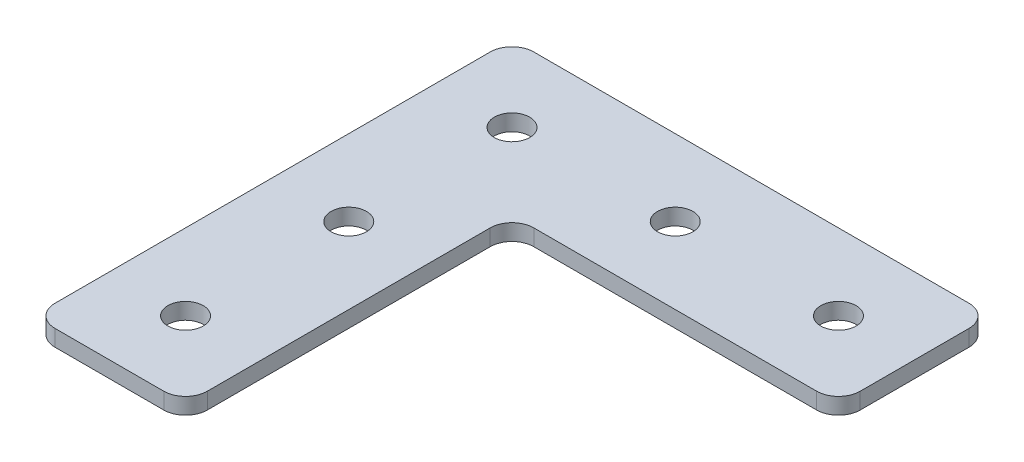
ISO-10303-21;
HEADER;
FILE_DESCRIPTION(('STEP AP214'),'2;1');
FILE_NAME('part.step','',(''),(''),'','','');
FILE_SCHEMA(('AUTOMOTIVE_DESIGN { 1 0 10303 214 1 1 1 1 }'));
ENDSEC;
DATA;
#1=APPLICATION_CONTEXT('core data for automotive mechanical design processes');
#2=APPLICATION_PROTOCOL_DEFINITION('international standard','automotive_design',2000,#1);
#3=PRODUCT_CONTEXT('',#1,'mechanical');
#4=PRODUCT('Part','Part','',(#3));
#5=PRODUCT_RELATED_PRODUCT_CATEGORY('part','',(#4));
#6=PRODUCT_DEFINITION_FORMATION('','',#4);
#7=PRODUCT_DEFINITION_CONTEXT('part definition',#1,'design');
#8=PRODUCT_DEFINITION('design','',#6,#7);
#9=PRODUCT_DEFINITION_SHAPE('','',#8);
#10=(LENGTH_UNIT() NAMED_UNIT(*) SI_UNIT(.MILLI.,.METRE.));
#11=(NAMED_UNIT(*) PLANE_ANGLE_UNIT() SI_UNIT($,.RADIAN.));
#12=(NAMED_UNIT(*) SI_UNIT($,.STERADIAN.) SOLID_ANGLE_UNIT());
#13=UNCERTAINTY_MEASURE_WITH_UNIT(LENGTH_MEASURE(1.E-05),#10,'distance_accuracy_value','');
#14=(GEOMETRIC_REPRESENTATION_CONTEXT(3) GLOBAL_UNCERTAINTY_ASSIGNED_CONTEXT((#13)) GLOBAL_UNIT_ASSIGNED_CONTEXT((#10,
#11,#12)) REPRESENTATION_CONTEXT('',''));
#15=CARTESIAN_POINT('',(0.,0.,0.));
#16=DIRECTION('',(0.,0.,1.));
#17=DIRECTION('',(1.,0.,0.));
#18=AXIS2_PLACEMENT_3D('',#15,#16,#17);
#19=CARTESIAN_POINT('',(-16.7204202318338,1.74134831028641,-15.7705231973886));
#20=DIRECTION('',(0.,-1.,0.));
#21=DIRECTION('',(0.,0.,-1.));
#22=AXIS2_PLACEMENT_3D('',#19,#20,#21);
#23=PLANE('',#22);
#24=CARTESIAN_POINT('',(13.2795797681662,1.74134831028641,-15.7705231973886));
#25=DIRECTION('',(0.,1.,0.));
#26=DIRECTION('',(0.,0.,1.));
#27=AXIS2_PLACEMENT_3D('',#24,#25,#26);
#28=CIRCLE('',#27,1.625);
#29=CARTESIAN_POINT('',(13.2795797681662,1.74134831028641,-14.1455231973886));
#30=VERTEX_POINT('',#29);
#31=EDGE_CURVE('E335',#30,#30,#28,.T.);
#32=ORIENTED_EDGE('',*,*,#31,.T.);
#33=EDGE_LOOP('',(#32));
#34=FACE_BOUND('',#33,.T.);
#35=CARTESIAN_POINT('',(-16.7204202318339,1.74134831028641,14.2294768026113));
#36=DIRECTION('',(0.,1.,0.));
#37=DIRECTION('',(0.,0.,1.));
#38=AXIS2_PLACEMENT_3D('',#35,#36,#37);
#39=CIRCLE('',#38,1.625);
#40=CARTESIAN_POINT('',(-16.7204202318339,1.74134831028641,15.8544768026114));
#41=VERTEX_POINT('',#40);
#42=EDGE_CURVE('E331',#41,#41,#39,.T.);
#43=ORIENTED_EDGE('',*,*,#42,.T.);
#44=EDGE_LOOP('',(#43));
#45=FACE_BOUND('',#44,.T.);
#46=CARTESIAN_POINT('',(-16.7204202318339,1.74134831028641,-0.770523197388649));
#47=DIRECTION('',(0.,1.,0.));
#48=DIRECTION('',(0.,0.,1.));
#49=AXIS2_PLACEMENT_3D('',#46,#47,#48);
#50=CIRCLE('',#49,1.625);
#51=CARTESIAN_POINT('',(-16.7204202318339,1.74134831028641,0.854476802611351));
#52=VERTEX_POINT('',#51);
#53=EDGE_CURVE('E327',#52,#52,#50,.T.);
#54=ORIENTED_EDGE('',*,*,#53,.T.);
#55=EDGE_LOOP('',(#54));
#56=FACE_BOUND('',#55,.T.);
#57=CARTESIAN_POINT('',(-1.72042023183384,1.74134831028641,-15.7705231973886));
#58=DIRECTION('',(0.,1.,0.));
#59=DIRECTION('',(0.,0.,1.));
#60=AXIS2_PLACEMENT_3D('',#57,#58,#59);
#61=CIRCLE('',#60,1.625);
#62=CARTESIAN_POINT('',(-1.72042023183384,1.74134831028641,-14.1455231973886));
#63=VERTEX_POINT('',#62);
#64=EDGE_CURVE('E321',#63,#63,#61,.T.);
#65=ORIENTED_EDGE('',*,*,#64,.T.);
#66=EDGE_LOOP('',(#65));
#67=FACE_BOUND('',#66,.T.);
#68=CARTESIAN_POINT('',(-16.7204202318338,1.74134831028641,-15.7705231973886));
#69=DIRECTION('',(0.,1.,0.));
#70=DIRECTION('',(0.,0.,1.));
#71=AXIS2_PLACEMENT_3D('',#68,#69,#70);
#72=CIRCLE('',#71,1.625);
#73=CARTESIAN_POINT('',(-16.7204202318338,1.74134831028641,-14.1455231973886));
#74=VERTEX_POINT('',#73);
#75=EDGE_CURVE('E187',#74,#74,#72,.T.);
#76=ORIENTED_EDGE('',*,*,#75,.T.);
#77=EDGE_LOOP('',(#76));
#78=FACE_BOUND('',#77,.T.);
#79=DIRECTION('',(-1.,0.,0.));
#80=VECTOR('',#79,1.);
#81=CARTESIAN_POINT('',(20.2795797681661,1.74134831028641,-22.7705231973887));
#82=LINE('',#81,#80);
#83=CARTESIAN_POINT('',(18.2795797681661,1.74134831028641,-22.7705231973887));
#84=VERTEX_POINT('',#83);
#85=CARTESIAN_POINT('',(-21.7204202318339,1.74134831028641,-22.7705231973887));
#86=VERTEX_POINT('',#85);
#87=EDGE_CURVE('E208',#84,#86,#82,.T.);
#88=ORIENTED_EDGE('',*,*,#87,.F.);
#89=CARTESIAN_POINT('',(18.2795797681661,1.74134831028641,-20.7705231973887));
#90=DIRECTION('',(0.,-1.,0.));
#91=DIRECTION('',(0.,0.,-1.));
#92=AXIS2_PLACEMENT_3D('',#89,#90,#91);
#93=CIRCLE('',#92,2.);
#94=CARTESIAN_POINT('',(20.2795797681661,1.74134831028641,-20.7705231973887));
#95=VERTEX_POINT('',#94);
#96=EDGE_CURVE('E159',#84,#95,#93,.T.);
#97=ORIENTED_EDGE('',*,*,#96,.T.);
#98=DIRECTION('',(0.,0.,-1.));
#99=VECTOR('',#98,1.);
#100=CARTESIAN_POINT('',(20.2795797681661,1.74134831028641,-8.77052319738861));
#101=LINE('',#100,#99);
#102=CARTESIAN_POINT('',(20.2795797681661,1.74134831028641,-10.7705231973886));
#103=VERTEX_POINT('',#102);
#104=EDGE_CURVE('E217',#103,#95,#101,.T.);
#105=ORIENTED_EDGE('',*,*,#104,.F.);
#106=CARTESIAN_POINT('',(18.279579768166,1.74134831028641,-10.7705231973886));
#107=DIRECTION('',(0.,-1.,0.));
#108=DIRECTION('',(0.,0.,-1.));
#109=AXIS2_PLACEMENT_3D('',#106,#107,#108);
#110=CIRCLE('',#109,2.);
#111=CARTESIAN_POINT('',(18.279579768166,1.74134831028641,-8.77052319738861));
#112=VERTEX_POINT('',#111);
#113=EDGE_CURVE('E131',#103,#112,#110,.T.);
#114=ORIENTED_EDGE('',*,*,#113,.T.);
#115=DIRECTION('',(1.,0.,0.));
#116=VECTOR('',#115,1.);
#117=CARTESIAN_POINT('',(-9.72042023183375,1.74134831028641,-8.77052319738861));
#118=LINE('',#117,#116);
#119=CARTESIAN_POINT('',(-7.72042023183375,1.74134831028641,-8.77052319738861));
#120=VERTEX_POINT('',#119);
#121=EDGE_CURVE('E194',#120,#112,#118,.T.);
#122=ORIENTED_EDGE('',*,*,#121,.F.);
#123=CARTESIAN_POINT('',(-7.72042023183375,1.74134831028641,-6.77052319738861));
#124=DIRECTION('',(0.,-1.,0.));
#125=DIRECTION('',(0.,0.,-1.));
#126=AXIS2_PLACEMENT_3D('',#123,#124,#125);
#127=CIRCLE('',#126,2.);
#128=CARTESIAN_POINT('',(-9.72042023183375,1.74134831028641,-6.77052319738861));
#129=VERTEX_POINT('',#128);
#130=EDGE_CURVE('E10',#120,#129,#127,.F.);
#131=ORIENTED_EDGE('',*,*,#130,.T.);
#132=DIRECTION('',(0.,0.,-1.));
#133=VECTOR('',#132,1.);
#134=CARTESIAN_POINT('',(-9.72042023183375,1.74134831028641,21.2294768026113));
#135=LINE('',#134,#133);
#136=CARTESIAN_POINT('',(-9.72042023183375,1.74134831028641,19.2294768026113));
#137=VERTEX_POINT('',#136);
#138=EDGE_CURVE('E132',#137,#129,#135,.T.);
#139=ORIENTED_EDGE('',*,*,#138,.F.);
#140=CARTESIAN_POINT('',(-11.7204202318337,1.74134831028641,19.2294768026113));
#141=DIRECTION('',(0.,-1.,0.));
#142=DIRECTION('',(0.,0.,-1.));
#143=AXIS2_PLACEMENT_3D('',#140,#141,#142);
#144=CIRCLE('',#143,2.);
#145=CARTESIAN_POINT('',(-11.7204202318338,1.74134831028641,21.2294768026113));
#146=VERTEX_POINT('',#145);
#147=EDGE_CURVE('E153',#137,#146,#144,.T.);
#148=ORIENTED_EDGE('',*,*,#147,.T.);
#149=DIRECTION('',(1.,0.,0.));
#150=VECTOR('',#149,1.);
#151=CARTESIAN_POINT('',(-23.7204202318339,1.74134831028641,21.2294768026113));
#152=LINE('',#151,#150);
#153=CARTESIAN_POINT('',(-21.7204202318339,1.74134831028641,21.2294768026113));
#154=VERTEX_POINT('',#153);
#155=EDGE_CURVE('E136',#154,#146,#152,.T.);
#156=ORIENTED_EDGE('',*,*,#155,.F.);
#157=CARTESIAN_POINT('',(-21.7204202318339,1.74134831028641,19.2294768026113));
#158=DIRECTION('',(0.,-1.,0.));
#159=DIRECTION('',(0.,0.,-1.));
#160=AXIS2_PLACEMENT_3D('',#157,#158,#159);
#161=CIRCLE('',#160,2.);
#162=CARTESIAN_POINT('',(-23.7204202318339,1.74134831028641,19.2294768026113));
#163=VERTEX_POINT('',#162);
#164=EDGE_CURVE('E31',#154,#163,#161,.T.);
#165=ORIENTED_EDGE('',*,*,#164,.T.);
#166=DIRECTION('',(0.,0.,1.));
#167=VECTOR('',#166,1.);
#168=CARTESIAN_POINT('',(-23.7204202318339,1.74134831028641,-22.7705231973887));
#169=LINE('',#168,#167);
#170=CARTESIAN_POINT('',(-23.7204202318339,1.74134831028641,-20.7705231973887));
#171=VERTEX_POINT('',#170);
#172=EDGE_CURVE('E206',#171,#163,#169,.T.);
#173=ORIENTED_EDGE('',*,*,#172,.F.);
#174=CARTESIAN_POINT('',(-21.7204202318339,1.74134831028641,-20.7705231973887));
#175=DIRECTION('',(0.,-1.,0.));
#176=DIRECTION('',(0.,0.,-1.));
#177=AXIS2_PLACEMENT_3D('',#174,#175,#176);
#178=CIRCLE('',#177,2.);
#179=EDGE_CURVE('E157',#171,#86,#178,.T.);
#180=ORIENTED_EDGE('',*,*,#179,.T.);
#181=EDGE_LOOP('',(#88,#97,#105,#114,#122,#131,#139,#148,#156,#165,#173,#180));
#182=FACE_BOUND('',#181,.T.);
#183=ADVANCED_FACE('F16',(#34,#45,#56,#67,#78,#182),#23,.T.);
#184=CARTESIAN_POINT('',(-9.72042023183375,1.74134831028641,-8.77052319738861));
#185=DIRECTION('',(0.,0.,1.));
#186=DIRECTION('',(1.,0.,0.));
#187=AXIS2_PLACEMENT_3D('',#184,#185,#186);
#188=PLANE('',#187);
#189=DIRECTION('',(1.,0.,0.));
#190=VECTOR('',#189,1.);
#191=CARTESIAN_POINT('',(-9.72042023183375,3.24134831028641,-8.77052319738861));
#192=LINE('',#191,#190);
#193=CARTESIAN_POINT('',(-7.72042023183375,3.24134831028641,-8.77052319738861));
#194=VERTEX_POINT('',#193);
#195=CARTESIAN_POINT('',(18.279579768166,3.24134831028641,-8.77052319738861));
#196=VERTEX_POINT('',#195);
#197=EDGE_CURVE('E111',#194,#196,#192,.T.);
#198=ORIENTED_EDGE('',*,*,#197,.F.);
#199=DIRECTION('',(0.,1.,0.));
#200=VECTOR('',#199,1.);
#201=CARTESIAN_POINT('',(-7.72042023183375,1.74134831028641,-8.77052319738861));
#202=LINE('',#201,#200);
#203=EDGE_CURVE('E177',#194,#120,#202,.F.);
#204=ORIENTED_EDGE('',*,*,#203,.T.);
#205=ORIENTED_EDGE('',*,*,#121,.T.);
#206=DIRECTION('',(0.,1.,0.));
#207=VECTOR('',#206,1.);
#208=CARTESIAN_POINT('',(18.279579768166,1.74134831028641,-8.77052319738861));
#209=LINE('',#208,#207);
#210=EDGE_CURVE('E175',#112,#196,#209,.T.);
#211=ORIENTED_EDGE('',*,*,#210,.T.);
#212=EDGE_LOOP('',(#198,#204,#205,#211));
#213=FACE_BOUND('',#212,.T.);
#214=ADVANCED_FACE('F184',(#213),#188,.T.);
#215=CARTESIAN_POINT('',(-9.72042023183375,1.74134831028641,21.2294768026113));
#216=DIRECTION('',(1.,0.,0.));
#217=DIRECTION('',(0.,0.,-1.));
#218=AXIS2_PLACEMENT_3D('',#215,#216,#217);
#219=PLANE('',#218);
#220=ORIENTED_EDGE('',*,*,#138,.T.);
#221=DIRECTION('',(0.,1.,0.));
#222=VECTOR('',#221,1.);
#223=CARTESIAN_POINT('',(-9.72042023183375,3.24134831028641,-6.77052319738861));
#224=LINE('',#223,#222);
#225=CARTESIAN_POINT('',(-9.72042023183375,3.24134831028641,-6.77052319738861));
#226=VERTEX_POINT('',#225);
#227=EDGE_CURVE('E172',#129,#226,#224,.T.);
#228=ORIENTED_EDGE('',*,*,#227,.T.);
#229=DIRECTION('',(0.,0.,-1.));
#230=VECTOR('',#229,1.);
#231=CARTESIAN_POINT('',(-9.72042023183375,3.24134831028641,21.2294768026113));
#232=LINE('',#231,#230);
#233=CARTESIAN_POINT('',(-9.72042023183375,3.24134831028641,19.2294768026113));
#234=VERTEX_POINT('',#233);
#235=EDGE_CURVE('E139',#234,#226,#232,.T.);
#236=ORIENTED_EDGE('',*,*,#235,.F.);
#237=DIRECTION('',(0.,1.,0.));
#238=VECTOR('',#237,1.);
#239=CARTESIAN_POINT('',(-9.72042023183375,1.74134831028641,19.2294768026113));
#240=LINE('',#239,#238);
#241=EDGE_CURVE('E170',#234,#137,#240,.F.);
#242=ORIENTED_EDGE('',*,*,#241,.T.);
#243=EDGE_LOOP('',(#220,#228,#236,#242));
#244=FACE_BOUND('',#243,.T.);
#245=ADVANCED_FACE('F196',(#244),#219,.T.);
#246=CARTESIAN_POINT('',(-23.7204202318339,1.74134831028641,21.2294768026113));
#247=DIRECTION('',(0.,0.,1.));
#248=DIRECTION('',(1.,0.,0.));
#249=AXIS2_PLACEMENT_3D('',#246,#247,#248);
#250=PLANE('',#249);
#251=DIRECTION('',(1.,0.,0.));
#252=VECTOR('',#251,1.);
#253=CARTESIAN_POINT('',(-23.7204202318339,3.24134831028641,21.2294768026113));
#254=LINE('',#253,#252);
#255=CARTESIAN_POINT('',(-21.7204202318339,3.24134831028641,21.2294768026113));
#256=VERTEX_POINT('',#255);
#257=CARTESIAN_POINT('',(-11.7204202318338,3.24134831028641,21.2294768026113));
#258=VERTEX_POINT('',#257);
#259=EDGE_CURVE('E216',#256,#258,#254,.T.);
#260=ORIENTED_EDGE('',*,*,#259,.F.);
#261=DIRECTION('',(0.,1.,0.));
#262=VECTOR('',#261,1.);
#263=CARTESIAN_POINT('',(-21.7204202318339,1.74134831028641,21.2294768026113));
#264=LINE('',#263,#262);
#265=EDGE_CURVE('E168',#256,#154,#264,.F.);
#266=ORIENTED_EDGE('',*,*,#265,.T.);
#267=ORIENTED_EDGE('',*,*,#155,.T.);
#268=DIRECTION('',(0.,1.,0.));
#269=VECTOR('',#268,1.);
#270=CARTESIAN_POINT('',(-11.7204202318338,1.74134831028641,21.2294768026113));
#271=LINE('',#270,#269);
#272=EDGE_CURVE('E165',#146,#258,#271,.T.);
#273=ORIENTED_EDGE('',*,*,#272,.T.);
#274=EDGE_LOOP('',(#260,#266,#267,#273));
#275=FACE_BOUND('',#274,.T.);
#276=ADVANCED_FACE('F203',(#275),#250,.T.);
#277=CARTESIAN_POINT('',(-23.7204202318339,1.74134831028641,-22.7705231973887));
#278=DIRECTION('',(-1.,0.,0.));
#279=DIRECTION('',(0.,0.,1.));
#280=AXIS2_PLACEMENT_3D('',#277,#278,#279);
#281=PLANE('',#280);
#282=DIRECTION('',(0.,0.,1.));
#283=VECTOR('',#282,1.);
#284=CARTESIAN_POINT('',(-23.7204202318339,3.24134831028641,-22.7705231973887));
#285=LINE('',#284,#283);
#286=CARTESIAN_POINT('',(-23.7204202318339,3.24134831028641,-20.7705231973887));
#287=VERTEX_POINT('',#286);
#288=CARTESIAN_POINT('',(-23.7204202318339,3.24134831028641,19.2294768026113));
#289=VERTEX_POINT('',#288);
#290=EDGE_CURVE('E214',#287,#289,#285,.T.);
#291=ORIENTED_EDGE('',*,*,#290,.F.);
#292=DIRECTION('',(0.,1.,0.));
#293=VECTOR('',#292,1.);
#294=CARTESIAN_POINT('',(-23.7204202318339,1.74134831028641,-20.7705231973887));
#295=LINE('',#294,#293);
#296=EDGE_CURVE('E38',#287,#171,#295,.F.);
#297=ORIENTED_EDGE('',*,*,#296,.T.);
#298=ORIENTED_EDGE('',*,*,#172,.T.);
#299=DIRECTION('',(0.,1.,0.));
#300=VECTOR('',#299,1.);
#301=CARTESIAN_POINT('',(-23.7204202318339,1.74134831028641,19.2294768026113));
#302=LINE('',#301,#300);
#303=EDGE_CURVE('E161',#163,#289,#302,.T.);
#304=ORIENTED_EDGE('',*,*,#303,.T.);
#305=EDGE_LOOP('',(#291,#297,#298,#304));
#306=FACE_BOUND('',#305,.T.);
#307=ADVANCED_FACE('F233',(#306),#281,.T.);
#308=CARTESIAN_POINT('',(20.2795797681661,1.74134831028641,-22.7705231973887));
#309=DIRECTION('',(0.,0.,-1.));
#310=DIRECTION('',(-1.,0.,0.));
#311=AXIS2_PLACEMENT_3D('',#308,#309,#310);
#312=PLANE('',#311);
#313=DIRECTION('',(-1.,0.,0.));
#314=VECTOR('',#313,1.);
#315=CARTESIAN_POINT('',(20.2795797681661,3.24134831028641,-22.7705231973887));
#316=LINE('',#315,#314);
#317=CARTESIAN_POINT('',(18.2795797681661,3.24134831028641,-22.7705231973887));
#318=VERTEX_POINT('',#317);
#319=CARTESIAN_POINT('',(-21.7204202318339,3.24134831028641,-22.7705231973887));
#320=VERTEX_POINT('',#319);
#321=EDGE_CURVE('E127',#318,#320,#316,.T.);
#322=ORIENTED_EDGE('',*,*,#321,.F.);
#323=DIRECTION('',(0.,1.,0.));
#324=VECTOR('',#323,1.);
#325=CARTESIAN_POINT('',(18.2795797681661,1.74134831028641,-22.7705231973887));
#326=LINE('',#325,#324);
#327=EDGE_CURVE('E151',#318,#84,#326,.F.);
#328=ORIENTED_EDGE('',*,*,#327,.T.);
#329=ORIENTED_EDGE('',*,*,#87,.T.);
#330=DIRECTION('',(0.,1.,0.));
#331=VECTOR('',#330,1.);
#332=CARTESIAN_POINT('',(-21.7204202318339,1.74134831028641,-22.7705231973887));
#333=LINE('',#332,#331);
#334=EDGE_CURVE('E148',#86,#320,#333,.T.);
#335=ORIENTED_EDGE('',*,*,#334,.T.);
#336=EDGE_LOOP('',(#322,#328,#329,#335));
#337=FACE_BOUND('',#336,.T.);
#338=ADVANCED_FACE('F227',(#337),#312,.T.);
#339=CARTESIAN_POINT('',(20.2795797681661,1.74134831028641,-8.77052319738861));
#340=DIRECTION('',(1.,0.,0.));
#341=DIRECTION('',(0.,0.,-1.));
#342=AXIS2_PLACEMENT_3D('',#339,#340,#341);
#343=PLANE('',#342);
#344=ORIENTED_EDGE('',*,*,#104,.T.);
#345=DIRECTION('',(0.,1.,0.));
#346=VECTOR('',#345,1.);
#347=CARTESIAN_POINT('',(20.2795797681661,1.74134831028641,-20.7705231973887));
#348=LINE('',#347,#346);
#349=CARTESIAN_POINT('',(20.2795797681661,3.24134831028641,-20.7705231973887));
#350=VERTEX_POINT('',#349);
#351=EDGE_CURVE('E126',#95,#350,#348,.T.);
#352=ORIENTED_EDGE('',*,*,#351,.T.);
#353=DIRECTION('',(0.,0.,-1.));
#354=VECTOR('',#353,1.);
#355=CARTESIAN_POINT('',(20.2795797681661,3.24134831028641,-8.77052319738861));
#356=LINE('',#355,#354);
#357=CARTESIAN_POINT('',(20.2795797681661,3.24134831028641,-10.7705231973886));
#358=VERTEX_POINT('',#357);
#359=EDGE_CURVE('E109',#358,#350,#356,.T.);
#360=ORIENTED_EDGE('',*,*,#359,.F.);
#361=DIRECTION('',(0.,1.,0.));
#362=VECTOR('',#361,1.);
#363=CARTESIAN_POINT('',(20.2795797681661,1.74134831028641,-10.7705231973886));
#364=LINE('',#363,#362);
#365=EDGE_CURVE('E123',#358,#103,#364,.F.);
#366=ORIENTED_EDGE('',*,*,#365,.T.);
#367=EDGE_LOOP('',(#344,#352,#360,#366));
#368=FACE_BOUND('',#367,.T.);
#369=ADVANCED_FACE('F122',(#368),#343,.T.);
#370=CARTESIAN_POINT('',(-16.7204202318338,3.24134831028641,-15.7705231973886));
#371=DIRECTION('',(0.,-1.,0.));
#372=DIRECTION('',(0.,0.,-1.));
#373=AXIS2_PLACEMENT_3D('',#370,#371,#372);
#374=PLANE('',#373);
#375=CARTESIAN_POINT('',(13.2795797681662,3.24134831028641,-15.7705231973886));
#376=DIRECTION('',(0.,1.,0.));
#377=DIRECTION('',(0.,0.,1.));
#378=AXIS2_PLACEMENT_3D('',#375,#376,#377);
#379=CIRCLE('',#378,1.625);
#380=CARTESIAN_POINT('',(13.2795797681662,3.24134831028641,-14.1455231973886));
#381=VERTEX_POINT('',#380);
#382=EDGE_CURVE('E305',#381,#381,#379,.T.);
#383=ORIENTED_EDGE('',*,*,#382,.F.);
#384=EDGE_LOOP('',(#383));
#385=FACE_BOUND('',#384,.T.);
#386=CARTESIAN_POINT('',(-16.7204202318339,3.24134831028641,14.2294768026113));
#387=DIRECTION('',(0.,1.,0.));
#388=DIRECTION('',(0.,0.,1.));
#389=AXIS2_PLACEMENT_3D('',#386,#387,#388);
#390=CIRCLE('',#389,1.625);
#391=CARTESIAN_POINT('',(-16.7204202318339,3.24134831028641,15.8544768026114));
#392=VERTEX_POINT('',#391);
#393=EDGE_CURVE('E309',#392,#392,#390,.T.);
#394=ORIENTED_EDGE('',*,*,#393,.F.);
#395=EDGE_LOOP('',(#394));
#396=FACE_BOUND('',#395,.T.);
#397=CARTESIAN_POINT('',(-16.7204202318339,3.24134831028641,-0.770523197388649));
#398=DIRECTION('',(0.,1.,0.));
#399=DIRECTION('',(0.,0.,1.));
#400=AXIS2_PLACEMENT_3D('',#397,#398,#399);
#401=CIRCLE('',#400,1.625);
#402=CARTESIAN_POINT('',(-16.7204202318339,3.24134831028641,0.854476802611351));
#403=VERTEX_POINT('',#402);
#404=EDGE_CURVE('E313',#403,#403,#401,.T.);
#405=ORIENTED_EDGE('',*,*,#404,.F.);
#406=EDGE_LOOP('',(#405));
#407=FACE_BOUND('',#406,.T.);
#408=CARTESIAN_POINT('',(-1.72042023183384,3.24134831028641,-15.7705231973886));
#409=DIRECTION('',(0.,1.,0.));
#410=DIRECTION('',(0.,0.,1.));
#411=AXIS2_PLACEMENT_3D('',#408,#409,#410);
#412=CIRCLE('',#411,1.625);
#413=CARTESIAN_POINT('',(-1.72042023183384,3.24134831028641,-14.1455231973886));
#414=VERTEX_POINT('',#413);
#415=EDGE_CURVE('E317',#414,#414,#412,.T.);
#416=ORIENTED_EDGE('',*,*,#415,.F.);
#417=EDGE_LOOP('',(#416));
#418=FACE_BOUND('',#417,.T.);
#419=CARTESIAN_POINT('',(-16.7204202318338,3.24134831028641,-15.7705231973886));
#420=DIRECTION('',(0.,1.,0.));
#421=DIRECTION('',(0.,0.,1.));
#422=AXIS2_PLACEMENT_3D('',#419,#420,#421);
#423=CIRCLE('',#422,1.625);
#424=CARTESIAN_POINT('',(-16.7204202318338,3.24134831028641,-14.1455231973886));
#425=VERTEX_POINT('',#424);
#426=EDGE_CURVE('E221',#425,#425,#423,.T.);
#427=ORIENTED_EDGE('',*,*,#426,.F.);
#428=EDGE_LOOP('',(#427));
#429=FACE_BOUND('',#428,.T.);
#430=ORIENTED_EDGE('',*,*,#359,.T.);
#431=CARTESIAN_POINT('',(18.2795797681661,3.24134831028641,-20.7705231973887));
#432=DIRECTION('',(0.,-1.,0.));
#433=DIRECTION('',(0.,0.,-1.));
#434=AXIS2_PLACEMENT_3D('',#431,#432,#433);
#435=CIRCLE('',#434,2.);
#436=EDGE_CURVE('E146',#350,#318,#435,.F.);
#437=ORIENTED_EDGE('',*,*,#436,.T.);
#438=ORIENTED_EDGE('',*,*,#321,.T.);
#439=CARTESIAN_POINT('',(-21.7204202318339,3.24134831028641,-20.7705231973887));
#440=DIRECTION('',(0.,-1.,0.));
#441=DIRECTION('',(0.,0.,-1.));
#442=AXIS2_PLACEMENT_3D('',#439,#440,#441);
#443=CIRCLE('',#442,2.);
#444=EDGE_CURVE('E144',#320,#287,#443,.F.);
#445=ORIENTED_EDGE('',*,*,#444,.T.);
#446=ORIENTED_EDGE('',*,*,#290,.T.);
#447=CARTESIAN_POINT('',(-21.7204202318339,3.24134831028641,19.2294768026113));
#448=DIRECTION('',(0.,-1.,0.));
#449=DIRECTION('',(0.,0.,-1.));
#450=AXIS2_PLACEMENT_3D('',#447,#448,#449);
#451=CIRCLE('',#450,2.);
#452=EDGE_CURVE('E116',#289,#256,#451,.F.);
#453=ORIENTED_EDGE('',*,*,#452,.T.);
#454=ORIENTED_EDGE('',*,*,#259,.T.);
#455=CARTESIAN_POINT('',(-11.7204202318337,3.24134831028641,19.2294768026113));
#456=DIRECTION('',(0.,-1.,0.));
#457=DIRECTION('',(0.,0.,-1.));
#458=AXIS2_PLACEMENT_3D('',#455,#456,#457);
#459=CIRCLE('',#458,2.);
#460=EDGE_CURVE('E117',#258,#234,#459,.F.);
#461=ORIENTED_EDGE('',*,*,#460,.T.);
#462=ORIENTED_EDGE('',*,*,#235,.T.);
#463=CARTESIAN_POINT('',(-7.72042023183375,3.24134831028641,-6.77052319738861));
#464=DIRECTION('',(0.,-1.,0.));
#465=DIRECTION('',(0.,0.,-1.));
#466=AXIS2_PLACEMENT_3D('',#463,#464,#465);
#467=CIRCLE('',#466,2.);
#468=EDGE_CURVE('E24',#226,#194,#467,.T.);
#469=ORIENTED_EDGE('',*,*,#468,.T.);
#470=ORIENTED_EDGE('',*,*,#197,.T.);
#471=CARTESIAN_POINT('',(18.279579768166,3.24134831028641,-10.7705231973886));
#472=DIRECTION('',(0.,-1.,0.));
#473=DIRECTION('',(0.,0.,-1.));
#474=AXIS2_PLACEMENT_3D('',#471,#472,#473);
#475=CIRCLE('',#474,2.);
#476=EDGE_CURVE('E106',#196,#358,#475,.F.);
#477=ORIENTED_EDGE('',*,*,#476,.T.);
#478=EDGE_LOOP('',(#430,#437,#438,#445,#446,#453,#454,#461,#462,#469,#470,#477));
#479=FACE_BOUND('',#478,.T.);
#480=ADVANCED_FACE('F108',(#385,#396,#407,#418,#429,#479),#374,.F.);
#481=CARTESIAN_POINT('',(-16.7204202318338,1.74134831028641,-15.7705231973886));
#482=DIRECTION('',(0.,1.,0.));
#483=DIRECTION('',(0.,0.,1.));
#484=AXIS2_PLACEMENT_3D('',#481,#482,#483);
#485=CYLINDRICAL_SURFACE('',#484,1.625);
#486=ORIENTED_EDGE('',*,*,#75,.F.);
#487=EDGE_LOOP('',(#486));
#488=FACE_BOUND('',#487,.T.);
#489=ORIENTED_EDGE('',*,*,#426,.T.);
#490=EDGE_LOOP('',(#489));
#491=FACE_BOUND('',#490,.T.);
#492=ADVANCED_FACE('F282',(#488,#491),#485,.F.);
#493=CARTESIAN_POINT('',(-1.72042023183384,1.74134831028641,-15.7705231973886));
#494=DIRECTION('',(0.,1.,0.));
#495=DIRECTION('',(0.,0.,1.));
#496=AXIS2_PLACEMENT_3D('',#493,#494,#495);
#497=CYLINDRICAL_SURFACE('',#496,1.625);
#498=ORIENTED_EDGE('',*,*,#64,.F.);
#499=EDGE_LOOP('',(#498));
#500=FACE_BOUND('',#499,.T.);
#501=ORIENTED_EDGE('',*,*,#415,.T.);
#502=EDGE_LOOP('',(#501));
#503=FACE_BOUND('',#502,.T.);
#504=ADVANCED_FACE('F278',(#500,#503),#497,.F.);
#505=CARTESIAN_POINT('',(-16.7204202318339,1.74134831028641,-0.770523197388649));
#506=DIRECTION('',(0.,1.,0.));
#507=DIRECTION('',(0.,0.,1.));
#508=AXIS2_PLACEMENT_3D('',#505,#506,#507);
#509=CYLINDRICAL_SURFACE('',#508,1.625);
#510=ORIENTED_EDGE('',*,*,#53,.F.);
#511=EDGE_LOOP('',(#510));
#512=FACE_BOUND('',#511,.T.);
#513=ORIENTED_EDGE('',*,*,#404,.T.);
#514=EDGE_LOOP('',(#513));
#515=FACE_BOUND('',#514,.T.);
#516=ADVANCED_FACE('F270',(#512,#515),#509,.F.);
#517=CARTESIAN_POINT('',(-16.7204202318339,1.74134831028641,14.2294768026113));
#518=DIRECTION('',(0.,1.,0.));
#519=DIRECTION('',(0.,0.,1.));
#520=AXIS2_PLACEMENT_3D('',#517,#518,#519);
#521=CYLINDRICAL_SURFACE('',#520,1.625);
#522=ORIENTED_EDGE('',*,*,#42,.F.);
#523=EDGE_LOOP('',(#522));
#524=FACE_BOUND('',#523,.T.);
#525=ORIENTED_EDGE('',*,*,#393,.T.);
#526=EDGE_LOOP('',(#525));
#527=FACE_BOUND('',#526,.T.);
#528=ADVANCED_FACE('F264',(#524,#527),#521,.F.);
#529=CARTESIAN_POINT('',(13.2795797681662,1.74134831028641,-15.7705231973886));
#530=DIRECTION('',(0.,1.,0.));
#531=DIRECTION('',(0.,0.,1.));
#532=AXIS2_PLACEMENT_3D('',#529,#530,#531);
#533=CYLINDRICAL_SURFACE('',#532,1.625);
#534=ORIENTED_EDGE('',*,*,#31,.F.);
#535=EDGE_LOOP('',(#534));
#536=FACE_BOUND('',#535,.T.);
#537=ORIENTED_EDGE('',*,*,#382,.T.);
#538=EDGE_LOOP('',(#537));
#539=FACE_BOUND('',#538,.T.);
#540=ADVANCED_FACE('F259',(#536,#539),#533,.F.);
#541=CARTESIAN_POINT('',(18.2795797681661,1.74134831028641,-20.7705231973887));
#542=DIRECTION('',(0.,1.,0.));
#543=DIRECTION('',(0.,0.,1.));
#544=AXIS2_PLACEMENT_3D('',#541,#542,#543);
#545=CYLINDRICAL_SURFACE('',#544,2.);
#546=ORIENTED_EDGE('',*,*,#96,.F.);
#547=ORIENTED_EDGE('',*,*,#327,.F.);
#548=ORIENTED_EDGE('',*,*,#436,.F.);
#549=ORIENTED_EDGE('',*,*,#351,.F.);
#550=EDGE_LOOP('',(#546,#547,#548,#549));
#551=FACE_BOUND('',#550,.T.);
#552=ADVANCED_FACE('F245',(#551),#545,.T.);
#553=CARTESIAN_POINT('',(-21.7204202318339,1.74134831028641,-20.7705231973887));
#554=DIRECTION('',(0.,1.,0.));
#555=DIRECTION('',(0.,0.,1.));
#556=AXIS2_PLACEMENT_3D('',#553,#554,#555);
#557=CYLINDRICAL_SURFACE('',#556,2.);
#558=ORIENTED_EDGE('',*,*,#179,.F.);
#559=ORIENTED_EDGE('',*,*,#296,.F.);
#560=ORIENTED_EDGE('',*,*,#444,.F.);
#561=ORIENTED_EDGE('',*,*,#334,.F.);
#562=EDGE_LOOP('',(#558,#559,#560,#561));
#563=FACE_BOUND('',#562,.T.);
#564=ADVANCED_FACE('F232',(#563),#557,.T.);
#565=CARTESIAN_POINT('',(-21.7204202318339,1.74134831028641,19.2294768026113));
#566=DIRECTION('',(0.,1.,0.));
#567=DIRECTION('',(0.,0.,1.));
#568=AXIS2_PLACEMENT_3D('',#565,#566,#567);
#569=CYLINDRICAL_SURFACE('',#568,2.);
#570=ORIENTED_EDGE('',*,*,#164,.F.);
#571=ORIENTED_EDGE('',*,*,#265,.F.);
#572=ORIENTED_EDGE('',*,*,#452,.F.);
#573=ORIENTED_EDGE('',*,*,#303,.F.);
#574=EDGE_LOOP('',(#570,#571,#572,#573));
#575=FACE_BOUND('',#574,.T.);
#576=ADVANCED_FACE('F236',(#575),#569,.T.);
#577=CARTESIAN_POINT('',(-7.72042023183375,1.74134831028641,-6.77052319738861));
#578=DIRECTION('',(0.,-1.,0.));
#579=DIRECTION('',(0.,0.,-1.));
#580=AXIS2_PLACEMENT_3D('',#577,#578,#579);
#581=CYLINDRICAL_SURFACE('',#580,2.);
#582=ORIENTED_EDGE('',*,*,#130,.F.);
#583=ORIENTED_EDGE('',*,*,#203,.F.);
#584=ORIENTED_EDGE('',*,*,#468,.F.);
#585=ORIENTED_EDGE('',*,*,#227,.F.);
#586=EDGE_LOOP('',(#582,#583,#584,#585));
#587=FACE_BOUND('',#586,.T.);
#588=ADVANCED_FACE('F190',(#587),#581,.F.);
#589=CARTESIAN_POINT('',(18.279579768166,1.74134831028641,-10.7705231973886));
#590=DIRECTION('',(0.,1.,0.));
#591=DIRECTION('',(0.,0.,1.));
#592=AXIS2_PLACEMENT_3D('',#589,#590,#591);
#593=CYLINDRICAL_SURFACE('',#592,2.);
#594=ORIENTED_EDGE('',*,*,#113,.F.);
#595=ORIENTED_EDGE('',*,*,#365,.F.);
#596=ORIENTED_EDGE('',*,*,#476,.F.);
#597=ORIENTED_EDGE('',*,*,#210,.F.);
#598=EDGE_LOOP('',(#594,#595,#596,#597));
#599=FACE_BOUND('',#598,.T.);
#600=ADVANCED_FACE('F130',(#599),#593,.T.);
#601=CARTESIAN_POINT('',(-11.7204202318337,1.74134831028641,19.2294768026113));
#602=DIRECTION('',(0.,1.,0.));
#603=DIRECTION('',(0.,0.,1.));
#604=AXIS2_PLACEMENT_3D('',#601,#602,#603);
#605=CYLINDRICAL_SURFACE('',#604,2.);
#606=ORIENTED_EDGE('',*,*,#147,.F.);
#607=ORIENTED_EDGE('',*,*,#241,.F.);
#608=ORIENTED_EDGE('',*,*,#460,.F.);
#609=ORIENTED_EDGE('',*,*,#272,.F.);
#610=EDGE_LOOP('',(#606,#607,#608,#609));
#611=FACE_BOUND('',#610,.T.);
#612=ADVANCED_FACE('F18',(#611),#605,.T.);
#613=CLOSED_SHELL('',(#183,#214,#245,#276,#307,#338,#369,#480,#492,#504,#516,#528,#540,#552,
#564,#576,#588,#600,#612));
#614=MANIFOLD_SOLID_BREP('B1',#613);
#615=ADVANCED_BREP_SHAPE_REPRESENTATION('',(#18,#614),#14);
#616=SHAPE_DEFINITION_REPRESENTATION(#9,#615);
ENDSEC;
END-ISO-10303-21;
